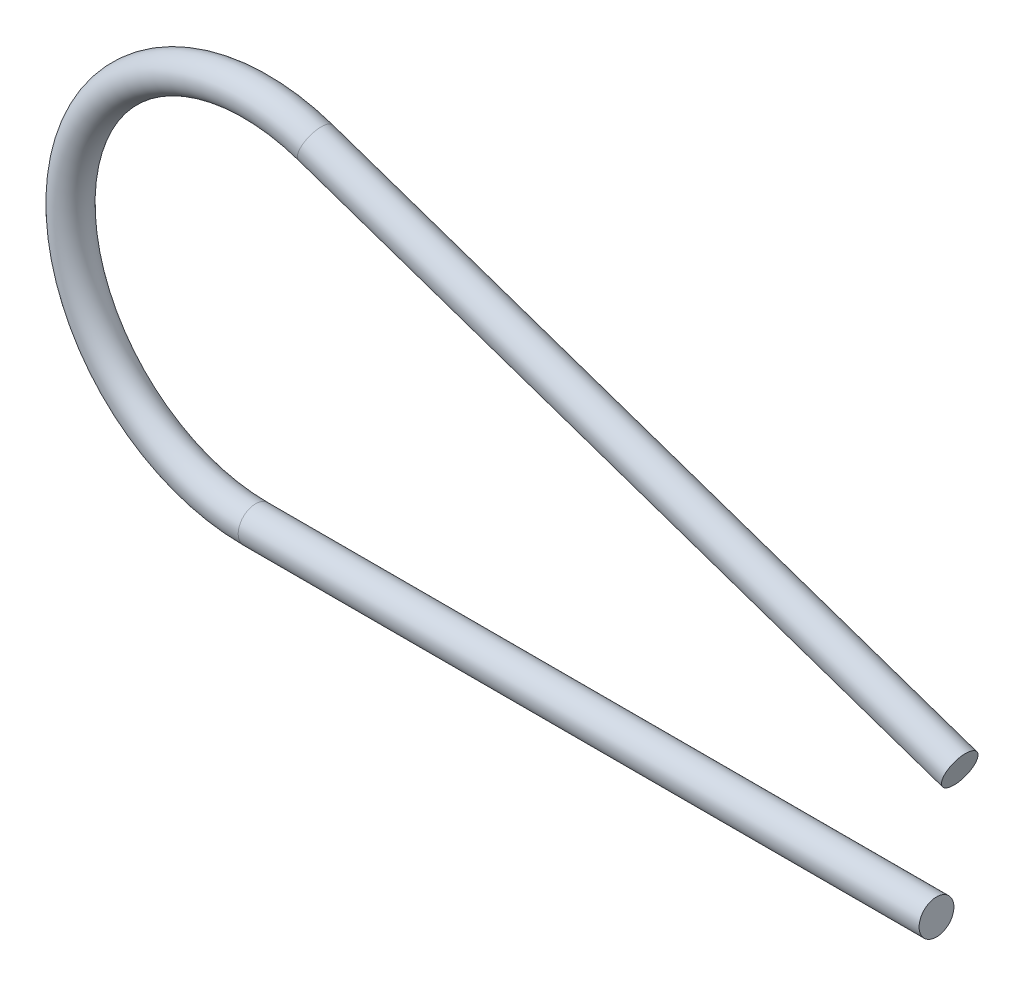
ISO-10303-21;
HEADER;
FILE_DESCRIPTION(('STEP AP214'),'2;1');
FILE_NAME('part.step','',(''),(''),'','','');
FILE_SCHEMA(('AUTOMOTIVE_DESIGN { 1 0 10303 214 1 1 1 1 }'));
ENDSEC;
DATA;
#1=APPLICATION_CONTEXT('core data for automotive mechanical design processes');
#2=APPLICATION_PROTOCOL_DEFINITION('international standard','automotive_design',2000,#1);
#3=PRODUCT_CONTEXT('',#1,'mechanical');
#4=PRODUCT('Part','Part','',(#3));
#5=PRODUCT_RELATED_PRODUCT_CATEGORY('part','',(#4));
#6=PRODUCT_DEFINITION_FORMATION('','',#4);
#7=PRODUCT_DEFINITION_CONTEXT('part definition',#1,'design');
#8=PRODUCT_DEFINITION('design','',#6,#7);
#9=PRODUCT_DEFINITION_SHAPE('','',#8);
#10=(LENGTH_UNIT() NAMED_UNIT(*) SI_UNIT(.MILLI.,.METRE.));
#11=(NAMED_UNIT(*) PLANE_ANGLE_UNIT() SI_UNIT($,.RADIAN.));
#12=(NAMED_UNIT(*) SI_UNIT($,.STERADIAN.) SOLID_ANGLE_UNIT());
#13=UNCERTAINTY_MEASURE_WITH_UNIT(LENGTH_MEASURE(1.E-05),#10,'distance_accuracy_value','');
#14=(GEOMETRIC_REPRESENTATION_CONTEXT(3) GLOBAL_UNCERTAINTY_ASSIGNED_CONTEXT((#13)) GLOBAL_UNIT_ASSIGNED_CONTEXT((#10,
#11,#12)) REPRESENTATION_CONTEXT('',''));
#15=CARTESIAN_POINT('',(0.,0.,0.));
#16=DIRECTION('',(0.,0.,1.));
#17=DIRECTION('',(1.,0.,0.));
#18=AXIS2_PLACEMENT_3D('',#15,#16,#17);
#19=CARTESIAN_POINT('',(-5.35276135788344,3.10556022290211,0.));
#20=DIRECTION('',(0.9460180124569,-0.324114054164729,0.));
#21=DIRECTION('',(0.324114054164729,0.9460180124569,0.));
#22=AXIS2_PLACEMENT_3D('',#19,#20,#21);
#23=CYLINDRICAL_SURFACE('',#22,0.15);
#24=CARTESIAN_POINT('',(-5.35276135788344,3.10556022290211,0.));
#25=DIRECTION('',(-0.946018012456895,0.324114054164743,0.));
#26=DIRECTION('',(0.,0.,-1.));
#27=AXIS2_PLACEMENT_3D('',#24,#25,#26);
#28=CIRCLE('',#27,0.15);
#29=CARTESIAN_POINT('',(-5.30414424975873,3.24746292477064,0.));
#30=VERTEX_POINT('',#29);
#31=EDGE_CURVE('E37',#30,#30,#28,.T.);
#32=ORIENTED_EDGE('',*,*,#31,.F.);
#33=EDGE_LOOP('',(#32));
#34=FACE_BOUND('',#33,.T.);
#35=CARTESIAN_POINT('',(0.20036437523856,1.20301072495515,0.));
#36=DIRECTION('',(-0.946018012456895,0.324114054164743,0.));
#37=DIRECTION('',(0.,0.,-1.));
#38=AXIS2_PLACEMENT_3D('',#35,#36,#37);
#39=CIRCLE('',#38,0.15);
#40=CARTESIAN_POINT('',(0.20036437523856,1.20301072495515,-0.15));
#41=VERTEX_POINT('',#40);
#42=EDGE_CURVE('E10',#41,#41,#39,.T.);
#43=ORIENTED_EDGE('',*,*,#42,.T.);
#44=EDGE_LOOP('',(#43));
#45=FACE_BOUND('',#44,.T.);
#46=ADVANCED_FACE('F31',(#34,#45),#23,.T.);
#47=CARTESIAN_POINT('',(-5.87,1.59585379118936,0.));
#48=DIRECTION('',(0.,0.,-1.));
#49=DIRECTION('',(-1.,0.,0.));
#50=AXIS2_PLACEMENT_3D('',#47,#48,#49);
#51=TOROIDAL_SURFACE('',#50,1.59585379118936,0.15);
#52=CARTESIAN_POINT('',(-5.87,0.,0.));
#53=DIRECTION('',(1.,0.,0.));
#54=DIRECTION('',(0.,0.,-1.));
#55=AXIS2_PLACEMENT_3D('',#52,#53,#54);
#56=CIRCLE('',#55,0.15);
#57=CARTESIAN_POINT('',(-5.87,-0.15,0.));
#58=VERTEX_POINT('',#57);
#59=EDGE_CURVE('E41',#58,#58,#56,.T.);
#60=CARTESIAN_POINT('',(-5.87,1.59585379118936,0.));
#61=DIRECTION('',(0.,0.,-1.));
#62=DIRECTION('',(-1.,0.,0.));
#63=AXIS2_PLACEMENT_3D('',#60,#61,#62);
#64=CIRCLE('',#63,1.74585379118936);
#65=EDGE_CURVE('',#58,#30,#64,.T.);
#66=ORIENTED_EDGE('',*,*,#59,.F.);
#67=ORIENTED_EDGE('',*,*,#31,.T.);
#68=ORIENTED_EDGE('',*,*,#65,.T.);
#69=ORIENTED_EDGE('',*,*,#65,.F.);
#70=EDGE_LOOP('',(#66,#68,#67,#69));
#71=FACE_BOUND('',#70,.T.);
#72=ADVANCED_FACE('F56',(#71),#51,.T.);
#73=CARTESIAN_POINT('',(-5.87,0.,0.));
#74=DIRECTION('',(1.,0.,0.));
#75=DIRECTION('',(0.,1.,0.));
#76=AXIS2_PLACEMENT_3D('',#73,#74,#75);
#77=CYLINDRICAL_SURFACE('',#76,0.15);
#78=ORIENTED_EDGE('',*,*,#59,.T.);
#79=EDGE_LOOP('',(#78));
#80=FACE_BOUND('',#79,.T.);
#81=CARTESIAN_POINT('',(0.,0.,0.));
#82=DIRECTION('',(1.,0.,0.));
#83=DIRECTION('',(0.,0.,-1.));
#84=AXIS2_PLACEMENT_3D('',#81,#82,#83);
#85=CIRCLE('',#84,0.15);
#86=CARTESIAN_POINT('',(0.,0.,-0.15));
#87=VERTEX_POINT('',#86);
#88=EDGE_CURVE('E45',#87,#87,#85,.T.);
#89=ORIENTED_EDGE('',*,*,#88,.F.);
#90=EDGE_LOOP('',(#89));
#91=FACE_BOUND('',#90,.T.);
#92=ADVANCED_FACE('F53',(#80,#91),#77,.T.);
#93=CARTESIAN_POINT('',(0.20036437523856,1.20301072495515,0.));
#94=DIRECTION('',(-0.946018012456895,0.324114054164743,0.));
#95=DIRECTION('',(0.,0.,-1.));
#96=AXIS2_PLACEMENT_3D('',#93,#94,#95);
#97=PLANE('',#96);
#98=ORIENTED_EDGE('',*,*,#42,.F.);
#99=EDGE_LOOP('',(#98));
#100=FACE_BOUND('',#99,.T.);
#101=ADVANCED_FACE('F55',(#100),#97,.F.);
#102=CARTESIAN_POINT('',(0.,0.,0.));
#103=DIRECTION('',(1.,0.,0.));
#104=DIRECTION('',(0.,0.,-1.));
#105=AXIS2_PLACEMENT_3D('',#102,#103,#104);
#106=PLANE('',#105);
#107=ORIENTED_EDGE('',*,*,#88,.T.);
#108=EDGE_LOOP('',(#107));
#109=FACE_BOUND('',#108,.T.);
#110=ADVANCED_FACE('F51',(#109),#106,.T.);
#111=CLOSED_SHELL('',(#46,#72,#92,#101,#110));
#112=MANIFOLD_SOLID_BREP('B2',#111);
#113=ADVANCED_BREP_SHAPE_REPRESENTATION('',(#18,#112),#14);
#114=SHAPE_DEFINITION_REPRESENTATION(#9,#113);
ENDSEC;
END-ISO-10303-21;
